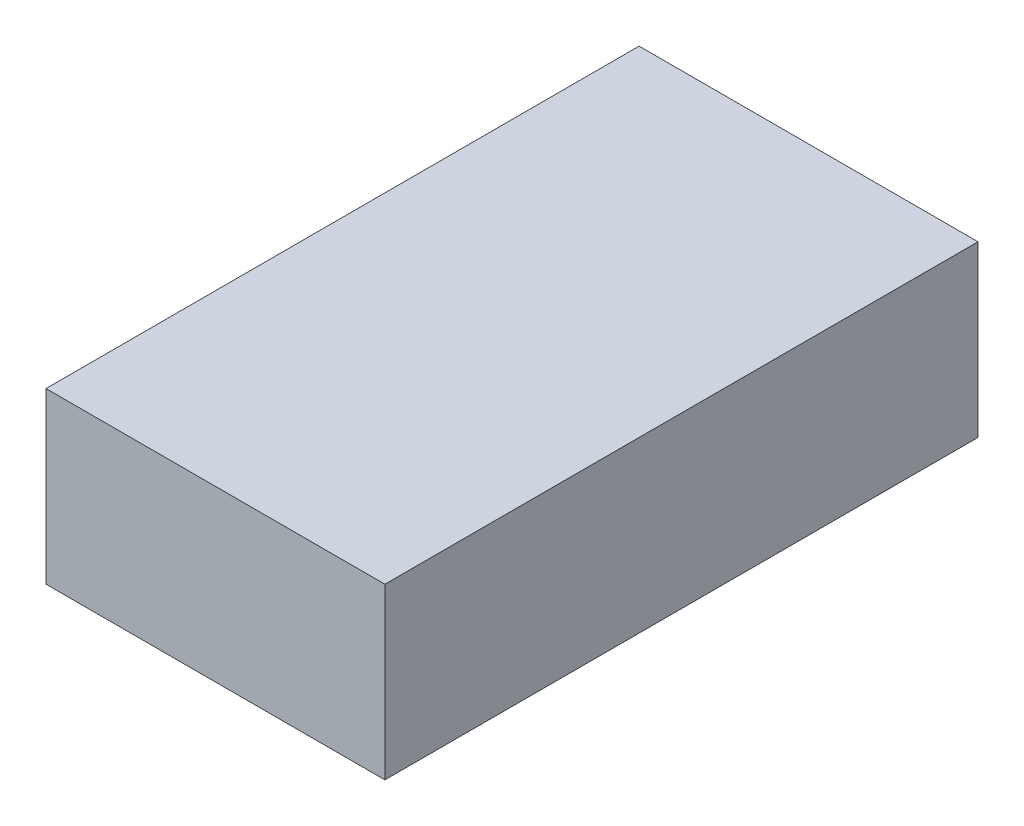
ISO-10303-21;
HEADER;
FILE_DESCRIPTION(('STEP AP214'),'2;1');
FILE_NAME('part.step','',(''),(''),'','','');
FILE_SCHEMA(('AUTOMOTIVE_DESIGN { 1 0 10303 214 1 1 1 1 }'));
ENDSEC;
DATA;
#1=APPLICATION_CONTEXT('core data for automotive mechanical design processes');
#2=APPLICATION_PROTOCOL_DEFINITION('international standard','automotive_design',2000,#1);
#3=PRODUCT_CONTEXT('',#1,'mechanical');
#4=PRODUCT('Part','Part','',(#3));
#5=PRODUCT_RELATED_PRODUCT_CATEGORY('part','',(#4));
#6=PRODUCT_DEFINITION_FORMATION('','',#4);
#7=PRODUCT_DEFINITION_CONTEXT('part definition',#1,'design');
#8=PRODUCT_DEFINITION('design','',#6,#7);
#9=PRODUCT_DEFINITION_SHAPE('','',#8);
#10=(LENGTH_UNIT() NAMED_UNIT(*) SI_UNIT(.MILLI.,.METRE.));
#11=(NAMED_UNIT(*) PLANE_ANGLE_UNIT() SI_UNIT($,.RADIAN.));
#12=(NAMED_UNIT(*) SI_UNIT($,.STERADIAN.) SOLID_ANGLE_UNIT());
#13=UNCERTAINTY_MEASURE_WITH_UNIT(LENGTH_MEASURE(1.E-05),#10,'distance_accuracy_value','');
#14=(GEOMETRIC_REPRESENTATION_CONTEXT(3) GLOBAL_UNCERTAINTY_ASSIGNED_CONTEXT((#13)) GLOBAL_UNIT_ASSIGNED_CONTEXT((#10,
#11,#12)) REPRESENTATION_CONTEXT('',''));
#15=CARTESIAN_POINT('',(0.,0.,0.));
#16=DIRECTION('',(0.,0.,1.));
#17=DIRECTION('',(1.,0.,0.));
#18=AXIS2_PLACEMENT_3D('',#15,#16,#17);
#19=CARTESIAN_POINT('',(0.,0.,280.));
#20=DIRECTION('',(1.,0.,0.));
#21=DIRECTION('',(0.,0.,-1.));
#22=AXIS2_PLACEMENT_3D('',#19,#20,#21);
#23=PLANE('',#22);
#24=DIRECTION('',(0.,-1.,0.));
#25=VECTOR('',#24,1.);
#26=CARTESIAN_POINT('',(0.,0.,0.));
#27=LINE('',#26,#25);
#28=CARTESIAN_POINT('',(0.,80.,0.));
#29=VERTEX_POINT('',#28);
#30=CARTESIAN_POINT('',(0.,0.,0.));
#31=VERTEX_POINT('',#30);
#32=EDGE_CURVE('E100',#29,#31,#27,.T.);
#33=ORIENTED_EDGE('',*,*,#32,.T.);
#34=DIRECTION('',(0.,0.,-1.));
#35=VECTOR('',#34,1.);
#36=CARTESIAN_POINT('',(0.,0.,280.));
#37=LINE('',#36,#35);
#38=CARTESIAN_POINT('',(0.,0.,280.));
#39=VERTEX_POINT('',#38);
#40=EDGE_CURVE('E11',#39,#31,#37,.T.);
#41=ORIENTED_EDGE('',*,*,#40,.F.);
#42=DIRECTION('',(0.,-1.,0.));
#43=VECTOR('',#42,1.);
#44=CARTESIAN_POINT('',(0.,0.,280.));
#45=LINE('',#44,#43);
#46=CARTESIAN_POINT('',(0.,80.,280.));
#47=VERTEX_POINT('',#46);
#48=EDGE_CURVE('E88',#47,#39,#45,.T.);
#49=ORIENTED_EDGE('',*,*,#48,.F.);
#50=DIRECTION('',(0.,0.,-1.));
#51=VECTOR('',#50,1.);
#52=CARTESIAN_POINT('',(0.,80.,280.));
#53=LINE('',#52,#51);
#54=EDGE_CURVE('E96',#47,#29,#53,.T.);
#55=ORIENTED_EDGE('',*,*,#54,.T.);
#56=EDGE_LOOP('',(#33,#41,#49,#55));
#57=FACE_BOUND('',#56,.T.);
#58=ADVANCED_FACE('F37',(#57),#23,.F.);
#59=CARTESIAN_POINT('',(0.,0.,280.));
#60=DIRECTION('',(0.,1.,0.));
#61=DIRECTION('',(0.,0.,1.));
#62=AXIS2_PLACEMENT_3D('',#59,#60,#61);
#63=PLANE('',#62);
#64=DIRECTION('',(1.,0.,0.));
#65=VECTOR('',#64,1.);
#66=CARTESIAN_POINT('',(0.,0.,0.));
#67=LINE('',#66,#65);
#68=CARTESIAN_POINT('',(160.,0.,0.));
#69=VERTEX_POINT('',#68);
#70=EDGE_CURVE('E92',#31,#69,#67,.T.);
#71=ORIENTED_EDGE('',*,*,#70,.T.);
#72=DIRECTION('',(0.,0.,-1.));
#73=VECTOR('',#72,1.);
#74=CARTESIAN_POINT('',(160.,0.,280.));
#75=LINE('',#74,#73);
#76=CARTESIAN_POINT('',(160.,0.,280.));
#77=VERTEX_POINT('',#76);
#78=EDGE_CURVE('E45',#77,#69,#75,.T.);
#79=ORIENTED_EDGE('',*,*,#78,.F.);
#80=DIRECTION('',(1.,0.,0.));
#81=VECTOR('',#80,1.);
#82=CARTESIAN_POINT('',(0.,0.,280.));
#83=LINE('',#82,#81);
#84=EDGE_CURVE('E83',#39,#77,#83,.T.);
#85=ORIENTED_EDGE('',*,*,#84,.F.);
#86=ORIENTED_EDGE('',*,*,#40,.T.);
#87=EDGE_LOOP('',(#71,#79,#85,#86));
#88=FACE_BOUND('',#87,.T.);
#89=ADVANCED_FACE('F91',(#88),#63,.F.);
#90=CARTESIAN_POINT('',(160.,0.,280.));
#91=DIRECTION('',(-1.,0.,0.));
#92=DIRECTION('',(0.,0.,1.));
#93=AXIS2_PLACEMENT_3D('',#90,#91,#92);
#94=PLANE('',#93);
#95=DIRECTION('',(0.,1.,0.));
#96=VECTOR('',#95,1.);
#97=CARTESIAN_POINT('',(160.,0.,0.));
#98=LINE('',#97,#96);
#99=CARTESIAN_POINT('',(160.,80.,0.));
#100=VERTEX_POINT('',#99);
#101=EDGE_CURVE('E70',#69,#100,#98,.T.);
#102=ORIENTED_EDGE('',*,*,#101,.T.);
#103=DIRECTION('',(0.,0.,-1.));
#104=VECTOR('',#103,1.);
#105=CARTESIAN_POINT('',(160.,80.,280.));
#106=LINE('',#105,#104);
#107=CARTESIAN_POINT('',(160.,80.,280.));
#108=VERTEX_POINT('',#107);
#109=EDGE_CURVE('E93',#108,#100,#106,.T.);
#110=ORIENTED_EDGE('',*,*,#109,.F.);
#111=DIRECTION('',(0.,1.,0.));
#112=VECTOR('',#111,1.);
#113=CARTESIAN_POINT('',(160.,0.,280.));
#114=LINE('',#113,#112);
#115=EDGE_CURVE('E86',#77,#108,#114,.T.);
#116=ORIENTED_EDGE('',*,*,#115,.F.);
#117=ORIENTED_EDGE('',*,*,#78,.T.);
#118=EDGE_LOOP('',(#102,#110,#116,#117));
#119=FACE_BOUND('',#118,.T.);
#120=ADVANCED_FACE('F94',(#119),#94,.F.);
#121=CARTESIAN_POINT('',(0.,80.,280.));
#122=DIRECTION('',(0.,-1.,0.));
#123=DIRECTION('',(0.,0.,-1.));
#124=AXIS2_PLACEMENT_3D('',#121,#122,#123);
#125=PLANE('',#124);
#126=DIRECTION('',(-1.,0.,0.));
#127=VECTOR('',#126,1.);
#128=CARTESIAN_POINT('',(0.,80.,0.));
#129=LINE('',#128,#127);
#130=EDGE_CURVE('E76',#100,#29,#129,.T.);
#131=ORIENTED_EDGE('',*,*,#130,.T.);
#132=ORIENTED_EDGE('',*,*,#54,.F.);
#133=DIRECTION('',(-1.,0.,0.));
#134=VECTOR('',#133,1.);
#135=CARTESIAN_POINT('',(0.,80.,280.));
#136=LINE('',#135,#134);
#137=EDGE_CURVE('E53',#108,#47,#136,.T.);
#138=ORIENTED_EDGE('',*,*,#137,.F.);
#139=ORIENTED_EDGE('',*,*,#109,.T.);
#140=EDGE_LOOP('',(#131,#132,#138,#139));
#141=FACE_BOUND('',#140,.T.);
#142=ADVANCED_FACE('F107',(#141),#125,.F.);
#143=CARTESIAN_POINT('',(0.,0.,280.));
#144=DIRECTION('',(0.,0.,-1.));
#145=DIRECTION('',(-1.,0.,0.));
#146=AXIS2_PLACEMENT_3D('',#143,#144,#145);
#147=PLANE('',#146);
#148=ORIENTED_EDGE('',*,*,#48,.T.);
#149=ORIENTED_EDGE('',*,*,#84,.T.);
#150=ORIENTED_EDGE('',*,*,#115,.T.);
#151=ORIENTED_EDGE('',*,*,#137,.T.);
#152=EDGE_LOOP('',(#148,#149,#150,#151));
#153=FACE_BOUND('',#152,.T.);
#154=ADVANCED_FACE('F84',(#153),#147,.F.);
#155=CARTESIAN_POINT('',(0.,0.,0.));
#156=DIRECTION('',(0.,0.,-1.));
#157=DIRECTION('',(-1.,0.,0.));
#158=AXIS2_PLACEMENT_3D('',#155,#156,#157);
#159=PLANE('',#158);
#160=ORIENTED_EDGE('',*,*,#32,.F.);
#161=ORIENTED_EDGE('',*,*,#130,.F.);
#162=ORIENTED_EDGE('',*,*,#101,.F.);
#163=ORIENTED_EDGE('',*,*,#70,.F.);
#164=EDGE_LOOP('',(#160,#161,#162,#163));
#165=FACE_BOUND('',#164,.T.);
#166=ADVANCED_FACE('F110',(#165),#159,.T.);
#167=CLOSED_SHELL('',(#58,#89,#120,#142,#154,#166));
#168=MANIFOLD_SOLID_BREP('B2',#167);
#169=ADVANCED_BREP_SHAPE_REPRESENTATION('',(#18,#168),#14);
#170=SHAPE_DEFINITION_REPRESENTATION(#9,#169);
ENDSEC;
END-ISO-10303-21;
